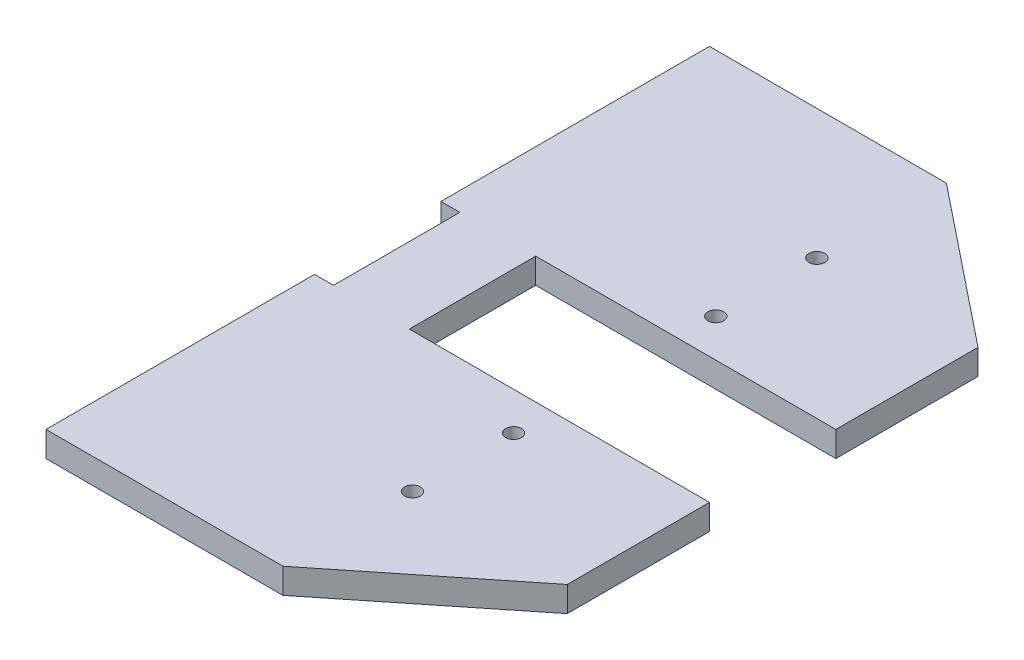
ISO-10303-21;
HEADER;
FILE_DESCRIPTION(('STEP AP214'),'2;1');
FILE_NAME('part.step','',(''),(''),'','','');
FILE_SCHEMA(('AUTOMOTIVE_DESIGN { 1 0 10303 214 1 1 1 1 }'));
ENDSEC;
DATA;
#1=APPLICATION_CONTEXT('core data for automotive mechanical design processes');
#2=APPLICATION_PROTOCOL_DEFINITION('international standard','automotive_design',2000,#1);
#3=PRODUCT_CONTEXT('',#1,'mechanical');
#4=PRODUCT('Part','Part','',(#3));
#5=PRODUCT_RELATED_PRODUCT_CATEGORY('part','',(#4));
#6=PRODUCT_DEFINITION_FORMATION('','',#4);
#7=PRODUCT_DEFINITION_CONTEXT('part definition',#1,'design');
#8=PRODUCT_DEFINITION('design','',#6,#7);
#9=PRODUCT_DEFINITION_SHAPE('','',#8);
#10=(LENGTH_UNIT() NAMED_UNIT(*) SI_UNIT(.MILLI.,.METRE.));
#11=(NAMED_UNIT(*) PLANE_ANGLE_UNIT() SI_UNIT($,.RADIAN.));
#12=(NAMED_UNIT(*) SI_UNIT($,.STERADIAN.) SOLID_ANGLE_UNIT());
#13=UNCERTAINTY_MEASURE_WITH_UNIT(LENGTH_MEASURE(1.E-05),#10,'distance_accuracy_value','');
#14=(GEOMETRIC_REPRESENTATION_CONTEXT(3) GLOBAL_UNCERTAINTY_ASSIGNED_CONTEXT((#13)) GLOBAL_UNIT_ASSIGNED_CONTEXT((#10,
#11,#12)) REPRESENTATION_CONTEXT('',''));
#15=CARTESIAN_POINT('',(0.,0.,0.));
#16=DIRECTION('',(0.,0.,1.));
#17=DIRECTION('',(1.,0.,0.));
#18=AXIS2_PLACEMENT_3D('',#15,#16,#17);
#19=CARTESIAN_POINT('',(17.8793532338309,0.,0.));
#20=DIRECTION('',(-1.,0.,0.));
#21=DIRECTION('',(0.,0.,1.));
#22=AXIS2_PLACEMENT_3D('',#19,#20,#21);
#23=PLANE('',#22);
#24=DIRECTION('',(0.,0.,1.));
#25=VECTOR('',#24,1.);
#26=CARTESIAN_POINT('',(17.8793532338309,8.,0.));
#27=LINE('',#26,#25);
#28=CARTESIAN_POINT('',(17.8793532338309,8.,15.0124378109453));
#29=VERTEX_POINT('',#28);
#30=CARTESIAN_POINT('',(17.8793532338309,8.00000000000001,100.012437810945));
#31=VERTEX_POINT('',#30);
#32=EDGE_CURVE('E163',#29,#31,#27,.T.);
#33=ORIENTED_EDGE('',*,*,#32,.F.);
#34=DIRECTION('',(0.,-1.,0.));
#35=VECTOR('',#34,1.);
#36=CARTESIAN_POINT('',(17.8793532338309,-103.077640640442,15.0124378109453));
#37=LINE('',#36,#35);
#38=CARTESIAN_POINT('',(17.8793532338309,0.,15.0124378109453));
#39=VERTEX_POINT('',#38);
#40=EDGE_CURVE('E140',#29,#39,#37,.T.);
#41=ORIENTED_EDGE('',*,*,#40,.T.);
#42=DIRECTION('',(0.,0.,1.));
#43=VECTOR('',#42,1.);
#44=CARTESIAN_POINT('',(17.8793532338309,0.,0.));
#45=LINE('',#44,#43);
#46=CARTESIAN_POINT('',(17.8793532338309,0.,100.012437810945));
#47=VERTEX_POINT('',#46);
#48=EDGE_CURVE('E151',#39,#47,#45,.T.);
#49=ORIENTED_EDGE('',*,*,#48,.T.);
#50=DIRECTION('',(0.,-1.,0.));
#51=VECTOR('',#50,1.);
#52=CARTESIAN_POINT('',(17.8793532338309,261.179778023443,100.012437810945));
#53=LINE('',#52,#51);
#54=EDGE_CURVE('E221',#31,#47,#53,.T.);
#55=ORIENTED_EDGE('',*,*,#54,.F.);
#56=EDGE_LOOP('',(#33,#41,#49,#55));
#57=FACE_BOUND('',#56,.T.);
#58=ADVANCED_FACE('F36',(#57),#23,.T.);
#59=CARTESIAN_POINT('',(17.8793532338309,0.,-109.987562189055));
#60=VERTEX_POINT('',#59);
#61=CARTESIAN_POINT('',(17.8793532338309,0.,-24.9875621890547));
#62=VERTEX_POINT('',#61);
#63=EDGE_CURVE('E158',#60,#62,#45,.T.);
#64=ORIENTED_EDGE('',*,*,#63,.T.);
#65=DIRECTION('',(0.,1.,0.));
#66=VECTOR('',#65,1.);
#67=CARTESIAN_POINT('',(17.8793532338309,-103.077640640442,-24.9875621890547));
#68=LINE('',#67,#66);
#69=CARTESIAN_POINT('',(17.8793532338309,8.,-24.9875621890547));
#70=VERTEX_POINT('',#69);
#71=EDGE_CURVE('E159',#62,#70,#68,.T.);
#72=ORIENTED_EDGE('',*,*,#71,.T.);
#73=CARTESIAN_POINT('',(17.8793532338309,8.00000000000001,-109.987562189055));
#74=VERTEX_POINT('',#73);
#75=EDGE_CURVE('E223',#74,#70,#27,.T.);
#76=ORIENTED_EDGE('',*,*,#75,.F.);
#77=DIRECTION('',(0.,1.,0.));
#78=VECTOR('',#77,1.);
#79=CARTESIAN_POINT('',(17.8793532338309,261.179778023443,-109.987562189055));
#80=LINE('',#79,#78);
#81=EDGE_CURVE('E218',#60,#74,#80,.T.);
#82=ORIENTED_EDGE('',*,*,#81,.F.);
#83=EDGE_LOOP('',(#64,#72,#76,#82));
#84=FACE_BOUND('',#83,.T.);
#85=ADVANCED_FACE('F232',(#84),#23,.T.);
#86=CARTESIAN_POINT('',(142.879353233831,8.,-69.9875621890547));
#87=DIRECTION('',(-1.,0.,0.));
#88=DIRECTION('',(0.,0.,1.));
#89=AXIS2_PLACEMENT_3D('',#86,#87,#88);
#90=PLANE('',#89);
#91=DIRECTION('',(0.,0.,-1.));
#92=VECTOR('',#91,1.);
#93=CARTESIAN_POINT('',(142.879353233831,0.,-69.9875621890547));
#94=LINE('',#93,#92);
#95=CARTESIAN_POINT('',(142.879353233831,0.,60.0124378109453));
#96=VERTEX_POINT('',#95);
#97=CARTESIAN_POINT('',(142.879353233831,0.,15.0124378109453));
#98=VERTEX_POINT('',#97);
#99=EDGE_CURVE('E297',#96,#98,#94,.T.);
#100=ORIENTED_EDGE('',*,*,#99,.T.);
#101=DIRECTION('',(0.,1.,0.));
#102=VECTOR('',#101,1.);
#103=CARTESIAN_POINT('',(142.879353233831,-103.077640640442,15.0124378109453));
#104=LINE('',#103,#102);
#105=CARTESIAN_POINT('',(142.879353233831,8.,15.0124378109453));
#106=VERTEX_POINT('',#105);
#107=EDGE_CURVE('E311',#98,#106,#104,.T.);
#108=ORIENTED_EDGE('',*,*,#107,.T.);
#109=DIRECTION('',(0.,0.,-1.));
#110=VECTOR('',#109,1.);
#111=CARTESIAN_POINT('',(142.879353233831,8.,-69.9875621890547));
#112=LINE('',#111,#110);
#113=CARTESIAN_POINT('',(142.879353233831,8.,60.0124378109453));
#114=VERTEX_POINT('',#113);
#115=EDGE_CURVE('E253',#114,#106,#112,.T.);
#116=ORIENTED_EDGE('',*,*,#115,.F.);
#117=DIRECTION('',(0.,-1.,0.));
#118=VECTOR('',#117,1.);
#119=CARTESIAN_POINT('',(142.879353233831,8.,60.0124378109453));
#120=LINE('',#119,#118);
#121=EDGE_CURVE('E220',#114,#96,#120,.T.);
#122=ORIENTED_EDGE('',*,*,#121,.T.);
#123=EDGE_LOOP('',(#100,#108,#116,#122));
#124=FACE_BOUND('',#123,.T.);
#125=ADVANCED_FACE('F263',(#124),#90,.F.);
#126=CARTESIAN_POINT('',(142.879353233831,-103.077640640442,15.0124378109453));
#127=DIRECTION('',(0.,0.,1.));
#128=DIRECTION('',(1.,0.,0.));
#129=AXIS2_PLACEMENT_3D('',#126,#127,#128);
#130=PLANE('',#129);
#131=DIRECTION('',(-1.,0.,0.));
#132=VECTOR('',#131,1.);
#133=CARTESIAN_POINT('',(142.879353233831,0.,15.0124378109453));
#134=LINE('',#133,#132);
#135=CARTESIAN_POINT('',(47.8793532338309,0.,15.0124378109453));
#136=VERTEX_POINT('',#135);
#137=EDGE_CURVE('E304',#98,#136,#134,.T.);
#138=ORIENTED_EDGE('',*,*,#137,.T.);
#139=DIRECTION('',(0.,1.,0.));
#140=VECTOR('',#139,1.);
#141=CARTESIAN_POINT('',(47.8793532338309,-103.077640640442,15.0124378109453));
#142=LINE('',#141,#140);
#143=CARTESIAN_POINT('',(47.8793532338309,8.,15.0124378109453));
#144=VERTEX_POINT('',#143);
#145=EDGE_CURVE('E309',#136,#144,#142,.T.);
#146=ORIENTED_EDGE('',*,*,#145,.T.);
#147=DIRECTION('',(1.,0.,0.));
#148=VECTOR('',#147,1.);
#149=CARTESIAN_POINT('',(142.879353233831,8.,15.0124378109453));
#150=LINE('',#149,#148);
#151=EDGE_CURVE('E306',#144,#106,#150,.T.);
#152=ORIENTED_EDGE('',*,*,#151,.T.);
#153=ORIENTED_EDGE('',*,*,#107,.F.);
#154=EDGE_LOOP('',(#138,#146,#152,#153));
#155=FACE_BOUND('',#154,.T.);
#156=ADVANCED_FACE('F265',(#155),#130,.F.);
#157=CARTESIAN_POINT('',(47.8793532338309,-103.077640640442,-24.9875621890547));
#158=DIRECTION('',(-1.,0.,0.));
#159=DIRECTION('',(0.,0.,1.));
#160=AXIS2_PLACEMENT_3D('',#157,#158,#159);
#161=PLANE('',#160);
#162=DIRECTION('',(0.,0.,-1.));
#163=VECTOR('',#162,1.);
#164=CARTESIAN_POINT('',(47.8793532338309,0.,-24.9875621890547));
#165=LINE('',#164,#163);
#166=CARTESIAN_POINT('',(47.8793532338309,0.,-24.9875621890547));
#167=VERTEX_POINT('',#166);
#168=EDGE_CURVE('E314',#136,#167,#165,.T.);
#169=ORIENTED_EDGE('',*,*,#168,.T.);
#170=DIRECTION('',(0.,1.,0.));
#171=VECTOR('',#170,1.);
#172=CARTESIAN_POINT('',(47.8793532338309,-103.077640640442,-24.9875621890547));
#173=LINE('',#172,#171);
#174=CARTESIAN_POINT('',(47.8793532338309,8.,-24.9875621890547));
#175=VERTEX_POINT('',#174);
#176=EDGE_CURVE('E307',#167,#175,#173,.T.);
#177=ORIENTED_EDGE('',*,*,#176,.T.);
#178=DIRECTION('',(0.,0.,1.));
#179=VECTOR('',#178,1.);
#180=CARTESIAN_POINT('',(47.8793532338309,8.,-24.9875621890547));
#181=LINE('',#180,#179);
#182=EDGE_CURVE('E316',#175,#144,#181,.T.);
#183=ORIENTED_EDGE('',*,*,#182,.T.);
#184=ORIENTED_EDGE('',*,*,#145,.F.);
#185=EDGE_LOOP('',(#169,#177,#183,#184));
#186=FACE_BOUND('',#185,.T.);
#187=ADVANCED_FACE('F273',(#186),#161,.F.);
#188=CARTESIAN_POINT('',(142.879353233831,-103.077640640442,-24.9875621890547));
#189=DIRECTION('',(0.,0.,-1.));
#190=DIRECTION('',(-1.,0.,0.));
#191=AXIS2_PLACEMENT_3D('',#188,#189,#190);
#192=PLANE('',#191);
#193=DIRECTION('',(1.,0.,0.));
#194=VECTOR('',#193,1.);
#195=CARTESIAN_POINT('',(142.879353233831,0.,-24.9875621890547));
#196=LINE('',#195,#194);
#197=CARTESIAN_POINT('',(142.879353233831,0.,-24.9875621890547));
#198=VERTEX_POINT('',#197);
#199=EDGE_CURVE('E302',#167,#198,#196,.T.);
#200=ORIENTED_EDGE('',*,*,#199,.T.);
#201=DIRECTION('',(0.,1.,0.));
#202=VECTOR('',#201,1.);
#203=CARTESIAN_POINT('',(142.879353233831,-103.077640640442,-24.9875621890547));
#204=LINE('',#203,#202);
#205=CARTESIAN_POINT('',(142.879353233831,8.,-24.9875621890547));
#206=VERTEX_POINT('',#205);
#207=EDGE_CURVE('E293',#198,#206,#204,.T.);
#208=ORIENTED_EDGE('',*,*,#207,.T.);
#209=DIRECTION('',(-1.,0.,0.));
#210=VECTOR('',#209,1.);
#211=CARTESIAN_POINT('',(142.879353233831,8.,-24.9875621890547));
#212=LINE('',#211,#210);
#213=EDGE_CURVE('E147',#206,#175,#212,.T.);
#214=ORIENTED_EDGE('',*,*,#213,.T.);
#215=ORIENTED_EDGE('',*,*,#176,.F.);
#216=EDGE_LOOP('',(#200,#208,#214,#215));
#217=FACE_BOUND('',#216,.T.);
#218=ADVANCED_FACE('F282',(#217),#192,.F.);
#219=CARTESIAN_POINT('',(142.879353233831,8.,-69.9875621890547));
#220=VERTEX_POINT('',#219);
#221=EDGE_CURVE('E292',#206,#220,#112,.T.);
#222=ORIENTED_EDGE('',*,*,#221,.F.);
#223=ORIENTED_EDGE('',*,*,#207,.F.);
#224=CARTESIAN_POINT('',(142.879353233831,0.,-69.9875621890547));
#225=VERTEX_POINT('',#224);
#226=EDGE_CURVE('E55',#198,#225,#94,.T.);
#227=ORIENTED_EDGE('',*,*,#226,.T.);
#228=DIRECTION('',(0.,-1.,0.));
#229=VECTOR('',#228,1.);
#230=CARTESIAN_POINT('',(142.879353233831,8.,-69.9875621890547));
#231=LINE('',#230,#229);
#232=EDGE_CURVE('E294',#220,#225,#231,.T.);
#233=ORIENTED_EDGE('',*,*,#232,.F.);
#234=EDGE_LOOP('',(#222,#223,#227,#233));
#235=FACE_BOUND('',#234,.T.);
#236=ADVANCED_FACE('F268',(#235),#90,.F.);
#237=CARTESIAN_POINT('',(92.8793532338309,-7.07106781186552,-36.9875621890547));
#238=DIRECTION('',(0.,1.,0.));
#239=DIRECTION('',(0.,0.,1.));
#240=AXIS2_PLACEMENT_3D('',#237,#238,#239);
#241=CYLINDRICAL_SURFACE('',#240,2.50000000000001);
#242=CARTESIAN_POINT('',(92.8793532338309,0.,-36.9875621890547));
#243=DIRECTION('',(0.,1.,0.));
#244=DIRECTION('',(0.,0.,1.));
#245=AXIS2_PLACEMENT_3D('',#242,#243,#244);
#246=CIRCLE('',#245,2.50000000000001);
#247=CARTESIAN_POINT('',(92.8793532338309,0.,-34.4875621890547));
#248=VERTEX_POINT('',#247);
#249=EDGE_CURVE('E206',#248,#248,#246,.T.);
#250=ORIENTED_EDGE('',*,*,#249,.F.);
#251=EDGE_LOOP('',(#250));
#252=FACE_BOUND('',#251,.T.);
#253=CARTESIAN_POINT('',(92.8793532338309,8.,-36.9875621890547));
#254=DIRECTION('',(0.,-1.,0.));
#255=DIRECTION('',(0.,0.,-1.));
#256=AXIS2_PLACEMENT_3D('',#253,#254,#255);
#257=CIRCLE('',#256,2.50000000000001);
#258=CARTESIAN_POINT('',(92.8793532338309,8.,-39.4875621890547));
#259=VERTEX_POINT('',#258);
#260=EDGE_CURVE('E212',#259,#259,#257,.T.);
#261=ORIENTED_EDGE('',*,*,#260,.F.);
#262=EDGE_LOOP('',(#261));
#263=FACE_BOUND('',#262,.T.);
#264=ADVANCED_FACE('F281',(#252,#263),#241,.F.);
#265=CARTESIAN_POINT('',(92.8793532338309,-7.07106781186552,-68.9875621890547));
#266=DIRECTION('',(0.,1.,0.));
#267=DIRECTION('',(0.,0.,1.));
#268=AXIS2_PLACEMENT_3D('',#265,#266,#267);
#269=CYLINDRICAL_SURFACE('',#268,2.50000000000001);
#270=CARTESIAN_POINT('',(92.8793532338309,0.,-68.9875621890547));
#271=DIRECTION('',(0.,1.,0.));
#272=DIRECTION('',(0.,0.,1.));
#273=AXIS2_PLACEMENT_3D('',#270,#271,#272);
#274=CIRCLE('',#273,2.50000000000001);
#275=CARTESIAN_POINT('',(92.8793532338309,0.,-66.4875621890547));
#276=VERTEX_POINT('',#275);
#277=EDGE_CURVE('E46',#276,#276,#274,.T.);
#278=ORIENTED_EDGE('',*,*,#277,.F.);
#279=EDGE_LOOP('',(#278));
#280=FACE_BOUND('',#279,.T.);
#281=CARTESIAN_POINT('',(92.8793532338309,8.,-68.9875621890547));
#282=DIRECTION('',(0.,-1.,0.));
#283=DIRECTION('',(0.,0.,-1.));
#284=AXIS2_PLACEMENT_3D('',#281,#282,#283);
#285=CIRCLE('',#284,2.50000000000001);
#286=CARTESIAN_POINT('',(92.8793532338309,8.,-71.4875621890547));
#287=VERTEX_POINT('',#286);
#288=EDGE_CURVE('E11',#287,#287,#285,.T.);
#289=ORIENTED_EDGE('',*,*,#288,.F.);
#290=EDGE_LOOP('',(#289));
#291=FACE_BOUND('',#290,.T.);
#292=ADVANCED_FACE('F287',(#280,#291),#269,.F.);
#293=CARTESIAN_POINT('',(92.8793532338309,-7.07106781186551,27.0124378109453));
#294=DIRECTION('',(0.,1.,0.));
#295=DIRECTION('',(0.,0.,1.));
#296=AXIS2_PLACEMENT_3D('',#293,#294,#295);
#297=CYLINDRICAL_SURFACE('',#296,2.50000000000001);
#298=CARTESIAN_POINT('',(92.8793532338309,0.,27.0124378109453));
#299=DIRECTION('',(0.,1.,0.));
#300=DIRECTION('',(0.,0.,1.));
#301=AXIS2_PLACEMENT_3D('',#298,#299,#300);
#302=CIRCLE('',#301,2.50000000000001);
#303=CARTESIAN_POINT('',(92.8793532338309,0.,29.5124378109453));
#304=VERTEX_POINT('',#303);
#305=EDGE_CURVE('E196',#304,#304,#302,.F.);
#306=ORIENTED_EDGE('',*,*,#305,.T.);
#307=EDGE_LOOP('',(#306));
#308=FACE_BOUND('',#307,.T.);
#309=CARTESIAN_POINT('',(92.8793532338309,8.,27.0124378109453));
#310=DIRECTION('',(0.,1.,0.));
#311=DIRECTION('',(0.,0.,1.));
#312=AXIS2_PLACEMENT_3D('',#309,#310,#311);
#313=CIRCLE('',#312,2.50000000000001);
#314=CARTESIAN_POINT('',(92.8793532338309,8.,29.5124378109453));
#315=VERTEX_POINT('',#314);
#316=EDGE_CURVE('E203',#315,#315,#313,.T.);
#317=ORIENTED_EDGE('',*,*,#316,.T.);
#318=EDGE_LOOP('',(#317));
#319=FACE_BOUND('',#318,.T.);
#320=ADVANCED_FACE('F333',(#308,#319),#297,.F.);
#321=CARTESIAN_POINT('',(92.8793532338309,-7.07106781186551,59.0124378109453));
#322=DIRECTION('',(0.,1.,0.));
#323=DIRECTION('',(0.,0.,1.));
#324=AXIS2_PLACEMENT_3D('',#321,#322,#323);
#325=CYLINDRICAL_SURFACE('',#324,2.50000000000001);
#326=CARTESIAN_POINT('',(92.8793532338309,0.,59.0124378109453));
#327=DIRECTION('',(0.,1.,0.));
#328=DIRECTION('',(0.,0.,1.));
#329=AXIS2_PLACEMENT_3D('',#326,#327,#328);
#330=CIRCLE('',#329,2.50000000000001);
#331=CARTESIAN_POINT('',(92.8793532338309,0.,61.5124378109453));
#332=VERTEX_POINT('',#331);
#333=EDGE_CURVE('E202',#332,#332,#330,.F.);
#334=ORIENTED_EDGE('',*,*,#333,.T.);
#335=EDGE_LOOP('',(#334));
#336=FACE_BOUND('',#335,.T.);
#337=CARTESIAN_POINT('',(92.8793532338309,8.,59.0124378109453));
#338=DIRECTION('',(0.,1.,0.));
#339=DIRECTION('',(0.,0.,1.));
#340=AXIS2_PLACEMENT_3D('',#337,#338,#339);
#341=CIRCLE('',#340,2.50000000000001);
#342=CARTESIAN_POINT('',(92.8793532338309,8.,61.5124378109453));
#343=VERTEX_POINT('',#342);
#344=EDGE_CURVE('E199',#343,#343,#341,.T.);
#345=ORIENTED_EDGE('',*,*,#344,.T.);
#346=EDGE_LOOP('',(#345));
#347=FACE_BOUND('',#346,.T.);
#348=ADVANCED_FACE('F325',(#336,#347),#325,.F.);
#349=CARTESIAN_POINT('',(23.8793532338309,-103.077640640442,-24.9875621890547));
#350=DIRECTION('',(1.,0.,0.));
#351=DIRECTION('',(0.,0.,-1.));
#352=AXIS2_PLACEMENT_3D('',#349,#350,#351);
#353=PLANE('',#352);
#354=DIRECTION('',(0.,0.,1.));
#355=VECTOR('',#354,1.);
#356=CARTESIAN_POINT('',(23.8793532338309,0.,-24.9875621890547));
#357=LINE('',#356,#355);
#358=CARTESIAN_POINT('',(23.8793532338309,0.,-24.9875621890547));
#359=VERTEX_POINT('',#358);
#360=CARTESIAN_POINT('',(23.8793532338309,0.,15.0124378109453));
#361=VERTEX_POINT('',#360);
#362=EDGE_CURVE('E169',#359,#361,#357,.T.);
#363=ORIENTED_EDGE('',*,*,#362,.T.);
#364=DIRECTION('',(0.,1.,0.));
#365=VECTOR('',#364,1.);
#366=CARTESIAN_POINT('',(23.8793532338309,-103.077640640442,15.0124378109453));
#367=LINE('',#366,#365);
#368=CARTESIAN_POINT('',(23.8793532338309,8.,15.0124378109453));
#369=VERTEX_POINT('',#368);
#370=EDGE_CURVE('E142',#361,#369,#367,.T.);
#371=ORIENTED_EDGE('',*,*,#370,.T.);
#372=DIRECTION('',(0.,0.,-1.));
#373=VECTOR('',#372,1.);
#374=CARTESIAN_POINT('',(23.8793532338309,8.,-24.9875621890547));
#375=LINE('',#374,#373);
#376=CARTESIAN_POINT('',(23.8793532338309,8.,-24.9875621890547));
#377=VERTEX_POINT('',#376);
#378=EDGE_CURVE('E172',#369,#377,#375,.T.);
#379=ORIENTED_EDGE('',*,*,#378,.T.);
#380=DIRECTION('',(0.,1.,0.));
#381=VECTOR('',#380,1.);
#382=CARTESIAN_POINT('',(23.8793532338309,-103.077640640442,-24.9875621890547));
#383=LINE('',#382,#381);
#384=EDGE_CURVE('E236',#359,#377,#383,.T.);
#385=ORIENTED_EDGE('',*,*,#384,.F.);
#386=EDGE_LOOP('',(#363,#371,#379,#385));
#387=FACE_BOUND('',#386,.T.);
#388=ADVANCED_FACE('F323',(#387),#353,.F.);
#389=CARTESIAN_POINT('',(92.8793532338309,261.179778023443,100.012437810945));
#390=DIRECTION('',(0.624695047554424,0.,0.78086880944303));
#391=DIRECTION('',(0.78086880944303,0.,-0.624695047554424));
#392=AXIS2_PLACEMENT_3D('',#389,#390,#391);
#393=PLANE('',#392);
#394=ORIENTED_EDGE('',*,*,#121,.F.);
#395=DIRECTION('',(-0.78086880944303,0.,0.624695047554424));
#396=VECTOR('',#395,1.);
#397=CARTESIAN_POINT('',(92.8793532338309,8.00000000000001,100.012437810945));
#398=LINE('',#397,#396);
#399=CARTESIAN_POINT('',(92.8793532338309,8.00000000000001,100.012437810945));
#400=VERTEX_POINT('',#399);
#401=EDGE_CURVE('E180',#114,#400,#398,.T.);
#402=ORIENTED_EDGE('',*,*,#401,.T.);
#403=DIRECTION('',(0.,-1.,0.));
#404=VECTOR('',#403,1.);
#405=CARTESIAN_POINT('',(92.8793532338309,261.179778023443,100.012437810945));
#406=LINE('',#405,#404);
#407=CARTESIAN_POINT('',(92.8793532338309,0.,100.012437810945));
#408=VERTEX_POINT('',#407);
#409=EDGE_CURVE('E178',#400,#408,#406,.T.);
#410=ORIENTED_EDGE('',*,*,#409,.T.);
#411=DIRECTION('',(-0.78086880944303,0.,0.624695047554424));
#412=VECTOR('',#411,1.);
#413=CARTESIAN_POINT('',(92.8793532338309,0.,100.012437810945));
#414=LINE('',#413,#412);
#415=EDGE_CURVE('E179',#96,#408,#414,.T.);
#416=ORIENTED_EDGE('',*,*,#415,.F.);
#417=EDGE_LOOP('',(#394,#402,#410,#416));
#418=FACE_BOUND('',#417,.T.);
#419=ADVANCED_FACE('F250',(#418),#393,.T.);
#420=CARTESIAN_POINT('',(92.8793532338309,261.179778023443,-109.987562189055));
#421=DIRECTION('',(0.624695047554424,0.,-0.78086880944303));
#422=DIRECTION('',(-0.78086880944303,0.,-0.624695047554424));
#423=AXIS2_PLACEMENT_3D('',#420,#421,#422);
#424=PLANE('',#423);
#425=DIRECTION('',(0.,-1.,0.));
#426=VECTOR('',#425,1.);
#427=CARTESIAN_POINT('',(92.8793532338309,261.179778023443,-109.987562189055));
#428=LINE('',#427,#426);
#429=CARTESIAN_POINT('',(92.8793532338309,8.00000000000001,-109.987562189055));
#430=VERTEX_POINT('',#429);
#431=CARTESIAN_POINT('',(92.8793532338309,0.,-109.987562189055));
#432=VERTEX_POINT('',#431);
#433=EDGE_CURVE('E197',#430,#432,#428,.T.);
#434=ORIENTED_EDGE('',*,*,#433,.F.);
#435=DIRECTION('',(0.78086880944303,0.,0.624695047554424));
#436=VECTOR('',#435,1.);
#437=CARTESIAN_POINT('',(92.8793532338309,8.00000000000001,-109.987562189055));
#438=LINE('',#437,#436);
#439=EDGE_CURVE('E193',#430,#220,#438,.T.);
#440=ORIENTED_EDGE('',*,*,#439,.T.);
#441=ORIENTED_EDGE('',*,*,#232,.T.);
#442=DIRECTION('',(0.78086880944303,0.,0.624695047554424));
#443=VECTOR('',#442,1.);
#444=CARTESIAN_POINT('',(92.8793532338309,0.,-109.987562189055));
#445=LINE('',#444,#443);
#446=EDGE_CURVE('E182',#432,#225,#445,.T.);
#447=ORIENTED_EDGE('',*,*,#446,.F.);
#448=EDGE_LOOP('',(#434,#440,#441,#447));
#449=FACE_BOUND('',#448,.T.);
#450=ADVANCED_FACE('F331',(#449),#424,.T.);
#451=CARTESIAN_POINT('',(0.,8.,0.));
#452=DIRECTION('',(0.,1.,0.));
#453=DIRECTION('',(0.,0.,1.));
#454=AXIS2_PLACEMENT_3D('',#451,#452,#453);
#455=PLANE('',#454);
#456=ORIENTED_EDGE('',*,*,#344,.F.);
#457=EDGE_LOOP('',(#456));
#458=FACE_BOUND('',#457,.T.);
#459=ORIENTED_EDGE('',*,*,#316,.F.);
#460=EDGE_LOOP('',(#459));
#461=FACE_BOUND('',#460,.T.);
#462=ORIENTED_EDGE('',*,*,#288,.T.);
#463=EDGE_LOOP('',(#462));
#464=FACE_BOUND('',#463,.T.);
#465=ORIENTED_EDGE('',*,*,#260,.T.);
#466=EDGE_LOOP('',(#465));
#467=FACE_BOUND('',#466,.T.);
#468=DIRECTION('',(1.,0.,0.));
#469=VECTOR('',#468,1.);
#470=CARTESIAN_POINT('',(-57.1206467661691,8.00000000000001,-109.987562189055));
#471=LINE('',#470,#469);
#472=EDGE_CURVE('E40',#74,#430,#471,.T.);
#473=ORIENTED_EDGE('',*,*,#472,.F.);
#474=ORIENTED_EDGE('',*,*,#75,.T.);
#475=DIRECTION('',(-1.,0.,0.));
#476=VECTOR('',#475,1.);
#477=CARTESIAN_POINT('',(-71.1206467661691,8.,-24.9875621890547));
#478=LINE('',#477,#476);
#479=EDGE_CURVE('E170',#377,#70,#478,.T.);
#480=ORIENTED_EDGE('',*,*,#479,.F.);
#481=ORIENTED_EDGE('',*,*,#378,.F.);
#482=DIRECTION('',(1.,0.,0.));
#483=VECTOR('',#482,1.);
#484=CARTESIAN_POINT('',(-71.1206467661691,8.,15.0124378109453));
#485=LINE('',#484,#483);
#486=EDGE_CURVE('E173',#29,#369,#485,.T.);
#487=ORIENTED_EDGE('',*,*,#486,.F.);
#488=ORIENTED_EDGE('',*,*,#32,.T.);
#489=DIRECTION('',(-1.,0.,0.));
#490=VECTOR('',#489,1.);
#491=CARTESIAN_POINT('',(-57.1206467661691,8.00000000000001,100.012437810945));
#492=LINE('',#491,#490);
#493=EDGE_CURVE('E175',#400,#31,#492,.T.);
#494=ORIENTED_EDGE('',*,*,#493,.F.);
#495=ORIENTED_EDGE('',*,*,#401,.F.);
#496=ORIENTED_EDGE('',*,*,#115,.T.);
#497=ORIENTED_EDGE('',*,*,#151,.F.);
#498=ORIENTED_EDGE('',*,*,#182,.F.);
#499=ORIENTED_EDGE('',*,*,#213,.F.);
#500=ORIENTED_EDGE('',*,*,#221,.T.);
#501=ORIENTED_EDGE('',*,*,#439,.F.);
#502=EDGE_LOOP('',(#473,#474,#480,#481,#487,#488,#494,#495,#496,#497,#498,#499,#500,#501));
#503=FACE_BOUND('',#502,.T.);
#504=ADVANCED_FACE('F239',(#458,#461,#464,#467,#503),#455,.T.);
#505=CARTESIAN_POINT('',(0.,0.,0.));
#506=DIRECTION('',(0.,1.,0.));
#507=DIRECTION('',(0.,0.,1.));
#508=AXIS2_PLACEMENT_3D('',#505,#506,#507);
#509=PLANE('',#508);
#510=ORIENTED_EDGE('',*,*,#333,.F.);
#511=EDGE_LOOP('',(#510));
#512=FACE_BOUND('',#511,.T.);
#513=ORIENTED_EDGE('',*,*,#305,.F.);
#514=EDGE_LOOP('',(#513));
#515=FACE_BOUND('',#514,.T.);
#516=ORIENTED_EDGE('',*,*,#277,.T.);
#517=EDGE_LOOP('',(#516));
#518=FACE_BOUND('',#517,.T.);
#519=ORIENTED_EDGE('',*,*,#249,.T.);
#520=EDGE_LOOP('',(#519));
#521=FACE_BOUND('',#520,.T.);
#522=ORIENTED_EDGE('',*,*,#63,.F.);
#523=DIRECTION('',(1.,0.,0.));
#524=VECTOR('',#523,1.);
#525=CARTESIAN_POINT('',(-57.1206467661691,0.,-109.987562189055));
#526=LINE('',#525,#524);
#527=EDGE_CURVE('E181',#60,#432,#526,.T.);
#528=ORIENTED_EDGE('',*,*,#527,.T.);
#529=ORIENTED_EDGE('',*,*,#446,.T.);
#530=ORIENTED_EDGE('',*,*,#226,.F.);
#531=ORIENTED_EDGE('',*,*,#199,.F.);
#532=ORIENTED_EDGE('',*,*,#168,.F.);
#533=ORIENTED_EDGE('',*,*,#137,.F.);
#534=ORIENTED_EDGE('',*,*,#99,.F.);
#535=ORIENTED_EDGE('',*,*,#415,.T.);
#536=DIRECTION('',(-1.,0.,0.));
#537=VECTOR('',#536,1.);
#538=CARTESIAN_POINT('',(-57.1206467661691,0.,100.012437810945));
#539=LINE('',#538,#537);
#540=EDGE_CURVE('E156',#408,#47,#539,.T.);
#541=ORIENTED_EDGE('',*,*,#540,.T.);
#542=ORIENTED_EDGE('',*,*,#48,.F.);
#543=DIRECTION('',(-1.,0.,0.));
#544=VECTOR('',#543,1.);
#545=CARTESIAN_POINT('',(-71.1206467661691,0.,15.0124378109453));
#546=LINE('',#545,#544);
#547=EDGE_CURVE('E136',#361,#39,#546,.T.);
#548=ORIENTED_EDGE('',*,*,#547,.F.);
#549=ORIENTED_EDGE('',*,*,#362,.F.);
#550=DIRECTION('',(1.,0.,0.));
#551=VECTOR('',#550,1.);
#552=CARTESIAN_POINT('',(-71.1206467661691,0.,-24.9875621890547));
#553=LINE('',#552,#551);
#554=EDGE_CURVE('E146',#62,#359,#553,.T.);
#555=ORIENTED_EDGE('',*,*,#554,.F.);
#556=EDGE_LOOP('',(#522,#528,#529,#530,#531,#532,#533,#534,#535,#541,#542,#548,#549,#555));
#557=FACE_BOUND('',#556,.T.);
#558=ADVANCED_FACE('F153',(#512,#515,#518,#521,#557),#509,.F.);
#559=CARTESIAN_POINT('',(-57.1206467661691,261.179778023443,-109.987562189055));
#560=DIRECTION('',(0.,0.,-1.));
#561=DIRECTION('',(-1.,0.,0.));
#562=AXIS2_PLACEMENT_3D('',#559,#560,#561);
#563=PLANE('',#562);
#564=ORIENTED_EDGE('',*,*,#527,.F.);
#565=ORIENTED_EDGE('',*,*,#81,.T.);
#566=ORIENTED_EDGE('',*,*,#472,.T.);
#567=ORIENTED_EDGE('',*,*,#433,.T.);
#568=EDGE_LOOP('',(#564,#565,#566,#567));
#569=FACE_BOUND('',#568,.T.);
#570=ADVANCED_FACE('F38',(#569),#563,.T.);
#571=CARTESIAN_POINT('',(-57.1206467661691,261.179778023443,100.012437810945));
#572=DIRECTION('',(0.,0.,1.));
#573=DIRECTION('',(1.,0.,0.));
#574=AXIS2_PLACEMENT_3D('',#571,#572,#573);
#575=PLANE('',#574);
#576=ORIENTED_EDGE('',*,*,#493,.T.);
#577=ORIENTED_EDGE('',*,*,#54,.T.);
#578=ORIENTED_EDGE('',*,*,#540,.F.);
#579=ORIENTED_EDGE('',*,*,#409,.F.);
#580=EDGE_LOOP('',(#576,#577,#578,#579));
#581=FACE_BOUND('',#580,.T.);
#582=ADVANCED_FACE('F255',(#581),#575,.T.);
#583=CARTESIAN_POINT('',(-71.1206467661691,-103.077640640442,15.0124378109453));
#584=DIRECTION('',(0.,0.,1.));
#585=DIRECTION('',(1.,0.,0.));
#586=AXIS2_PLACEMENT_3D('',#583,#584,#585);
#587=PLANE('',#586);
#588=ORIENTED_EDGE('',*,*,#40,.F.);
#589=ORIENTED_EDGE('',*,*,#486,.T.);
#590=ORIENTED_EDGE('',*,*,#370,.F.);
#591=ORIENTED_EDGE('',*,*,#547,.T.);
#592=EDGE_LOOP('',(#588,#589,#590,#591));
#593=FACE_BOUND('',#592,.T.);
#594=ADVANCED_FACE('F138',(#593),#587,.F.);
#595=CARTESIAN_POINT('',(-71.1206467661691,-103.077640640442,-24.9875621890547));
#596=DIRECTION('',(0.,0.,-1.));
#597=DIRECTION('',(-1.,0.,0.));
#598=AXIS2_PLACEMENT_3D('',#595,#596,#597);
#599=PLANE('',#598);
#600=ORIENTED_EDGE('',*,*,#71,.F.);
#601=ORIENTED_EDGE('',*,*,#554,.T.);
#602=ORIENTED_EDGE('',*,*,#384,.T.);
#603=ORIENTED_EDGE('',*,*,#479,.T.);
#604=EDGE_LOOP('',(#600,#601,#602,#603));
#605=FACE_BOUND('',#604,.T.);
#606=ADVANCED_FACE('F234',(#605),#599,.F.);
#607=CLOSED_SHELL('',(#58,#85,#125,#156,#187,#218,#236,#264,#292,#320,#348,#388,#419,#450,#504,
#558,#570,#582,#594,#606));
#608=MANIFOLD_SOLID_BREP('B2',#607);
#609=ADVANCED_BREP_SHAPE_REPRESENTATION('',(#18,#608),#14);
#610=SHAPE_DEFINITION_REPRESENTATION(#9,#609);
ENDSEC;
END-ISO-10303-21;
